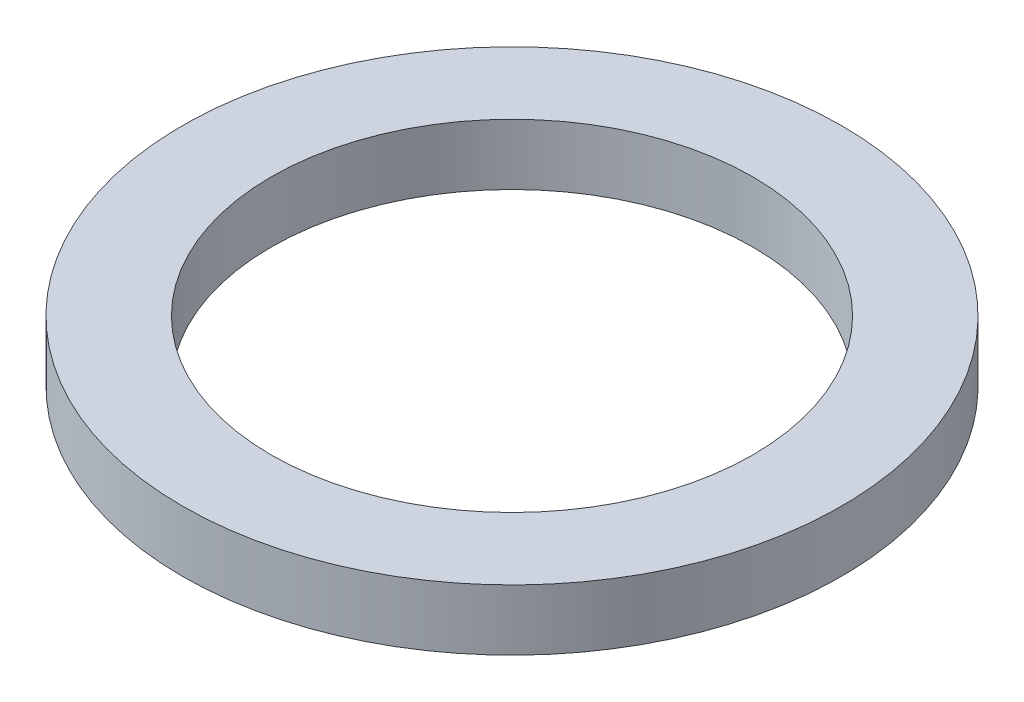
ISO-10303-21;
HEADER;
FILE_DESCRIPTION(('STEP AP214'),'2;1');
FILE_NAME('part.step','',(''),(''),'','','');
FILE_SCHEMA(('AUTOMOTIVE_DESIGN { 1 0 10303 214 1 1 1 1 }'));
ENDSEC;
DATA;
#1=APPLICATION_CONTEXT('core data for automotive mechanical design processes');
#2=APPLICATION_PROTOCOL_DEFINITION('international standard','automotive_design',2000,#1);
#3=PRODUCT_CONTEXT('',#1,'mechanical');
#4=PRODUCT('Part','Part','',(#3));
#5=PRODUCT_RELATED_PRODUCT_CATEGORY('part','',(#4));
#6=PRODUCT_DEFINITION_FORMATION('','',#4);
#7=PRODUCT_DEFINITION_CONTEXT('part definition',#1,'design');
#8=PRODUCT_DEFINITION('design','',#6,#7);
#9=PRODUCT_DEFINITION_SHAPE('','',#8);
#10=(LENGTH_UNIT() NAMED_UNIT(*) SI_UNIT(.MILLI.,.METRE.));
#11=(NAMED_UNIT(*) PLANE_ANGLE_UNIT() SI_UNIT($,.RADIAN.));
#12=(NAMED_UNIT(*) SI_UNIT($,.STERADIAN.) SOLID_ANGLE_UNIT());
#13=UNCERTAINTY_MEASURE_WITH_UNIT(LENGTH_MEASURE(1.E-05),#10,'distance_accuracy_value','');
#14=(GEOMETRIC_REPRESENTATION_CONTEXT(3) GLOBAL_UNCERTAINTY_ASSIGNED_CONTEXT((#13)) GLOBAL_UNIT_ASSIGNED_CONTEXT((#10,
#11,#12)) REPRESENTATION_CONTEXT('',''));
#15=CARTESIAN_POINT('',(0.,0.,0.));
#16=DIRECTION('',(0.,0.,1.));
#17=DIRECTION('',(1.,0.,0.));
#18=AXIS2_PLACEMENT_3D('',#15,#16,#17);
#19=CARTESIAN_POINT('',(0.,12.,0.));
#20=DIRECTION('',(0.,-1.,0.));
#21=DIRECTION('',(0.,0.,-1.));
#22=AXIS2_PLACEMENT_3D('',#19,#20,#21);
#23=CYLINDRICAL_SURFACE('',#22,65.);
#24=CARTESIAN_POINT('',(0.,12.,0.));
#25=DIRECTION('',(0.,1.,0.));
#26=DIRECTION('',(0.,0.,1.));
#27=AXIS2_PLACEMENT_3D('',#24,#25,#26);
#28=CIRCLE('',#27,65.);
#29=CARTESIAN_POINT('',(0.,12.,65.));
#30=VERTEX_POINT('',#29);
#31=EDGE_CURVE('E10',#30,#30,#28,.T.);
#32=ORIENTED_EDGE('',*,*,#31,.F.);
#33=EDGE_LOOP('',(#32));
#34=FACE_BOUND('',#33,.T.);
#35=CARTESIAN_POINT('',(0.,0.,0.));
#36=DIRECTION('',(0.,1.,0.));
#37=DIRECTION('',(0.,0.,1.));
#38=AXIS2_PLACEMENT_3D('',#35,#36,#37);
#39=CIRCLE('',#38,65.);
#40=CARTESIAN_POINT('',(0.,0.,65.));
#41=VERTEX_POINT('',#40);
#42=EDGE_CURVE('E37',#41,#41,#39,.T.);
#43=ORIENTED_EDGE('',*,*,#42,.T.);
#44=EDGE_LOOP('',(#43));
#45=FACE_BOUND('',#44,.T.);
#46=ADVANCED_FACE('F40',(#34,#45),#23,.T.);
#47=CARTESIAN_POINT('',(0.,12.,0.));
#48=DIRECTION('',(0.,1.,0.));
#49=DIRECTION('',(0.,0.,1.));
#50=AXIS2_PLACEMENT_3D('',#47,#48,#49);
#51=PLANE('',#50);
#52=CARTESIAN_POINT('',(0.,12.,0.));
#53=DIRECTION('',(0.,1.,0.));
#54=DIRECTION('',(0.,0.,1.));
#55=AXIS2_PLACEMENT_3D('',#52,#53,#54);
#56=CIRCLE('',#55,47.5);
#57=CARTESIAN_POINT('',(0.,12.,47.5));
#58=VERTEX_POINT('',#57);
#59=EDGE_CURVE('E50',#58,#58,#56,.T.);
#60=ORIENTED_EDGE('',*,*,#59,.F.);
#61=EDGE_LOOP('',(#60));
#62=FACE_BOUND('',#61,.T.);
#63=ORIENTED_EDGE('',*,*,#31,.T.);
#64=EDGE_LOOP('',(#63));
#65=FACE_BOUND('',#64,.T.);
#66=ADVANCED_FACE('F59',(#62,#65),#51,.T.);
#67=CARTESIAN_POINT('',(0.,0.,0.));
#68=DIRECTION('',(0.,1.,0.));
#69=DIRECTION('',(0.,0.,1.));
#70=AXIS2_PLACEMENT_3D('',#67,#68,#69);
#71=PLANE('',#70);
#72=CARTESIAN_POINT('',(0.,0.,0.));
#73=DIRECTION('',(0.,1.,0.));
#74=DIRECTION('',(0.,0.,1.));
#75=AXIS2_PLACEMENT_3D('',#72,#73,#74);
#76=CIRCLE('',#75,47.5);
#77=CARTESIAN_POINT('',(0.,0.,47.5));
#78=VERTEX_POINT('',#77);
#79=EDGE_CURVE('E47',#78,#78,#76,.T.);
#80=ORIENTED_EDGE('',*,*,#79,.T.);
#81=EDGE_LOOP('',(#80));
#82=FACE_BOUND('',#81,.T.);
#83=ORIENTED_EDGE('',*,*,#42,.F.);
#84=EDGE_LOOP('',(#83));
#85=FACE_BOUND('',#84,.T.);
#86=ADVANCED_FACE('F58',(#82,#85),#71,.F.);
#87=CARTESIAN_POINT('',(0.,12.,0.));
#88=DIRECTION('',(0.,-1.,0.));
#89=DIRECTION('',(0.,0.,-1.));
#90=AXIS2_PLACEMENT_3D('',#87,#88,#89);
#91=CYLINDRICAL_SURFACE('',#90,47.5);
#92=ORIENTED_EDGE('',*,*,#59,.T.);
#93=EDGE_LOOP('',(#92));
#94=FACE_BOUND('',#93,.T.);
#95=ORIENTED_EDGE('',*,*,#79,.F.);
#96=EDGE_LOOP('',(#95));
#97=FACE_BOUND('',#96,.T.);
#98=ADVANCED_FACE('F54',(#94,#97),#91,.F.);
#99=CLOSED_SHELL('',(#46,#66,#86,#98));
#100=MANIFOLD_SOLID_BREP('B2',#99);
#101=ADVANCED_BREP_SHAPE_REPRESENTATION('',(#18,#100),#14);
#102=SHAPE_DEFINITION_REPRESENTATION(#9,#101);
ENDSEC;
END-ISO-10303-21;
